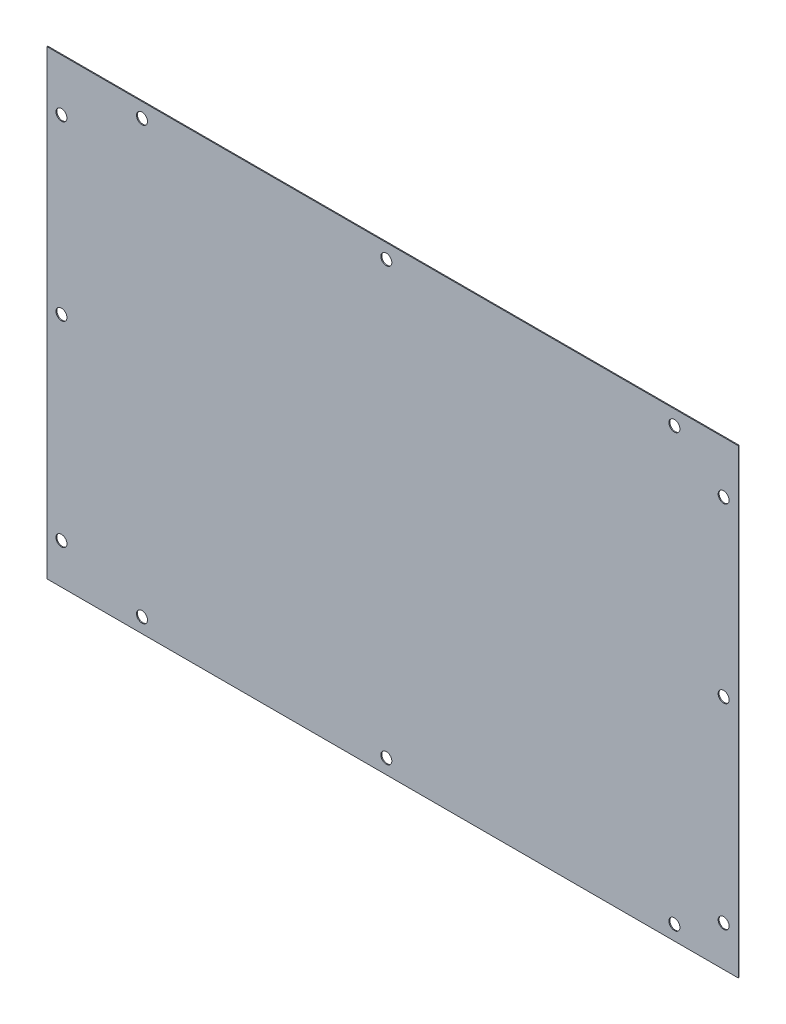
ISO-10303-21;
HEADER;
FILE_DESCRIPTION(('STEP AP214'),'2;1');
FILE_NAME('part.step','',(''),(''),'','','');
FILE_SCHEMA(('AUTOMOTIVE_DESIGN { 1 0 10303 214 1 1 1 1 }'));
ENDSEC;
DATA;
#1=APPLICATION_CONTEXT('core data for automotive mechanical design processes');
#2=APPLICATION_PROTOCOL_DEFINITION('international standard','automotive_design',2000,#1);
#3=PRODUCT_CONTEXT('',#1,'mechanical');
#4=PRODUCT('Part','Part','',(#3));
#5=PRODUCT_RELATED_PRODUCT_CATEGORY('part','',(#4));
#6=PRODUCT_DEFINITION_FORMATION('','',#4);
#7=PRODUCT_DEFINITION_CONTEXT('part definition',#1,'design');
#8=PRODUCT_DEFINITION('design','',#6,#7);
#9=PRODUCT_DEFINITION_SHAPE('','',#8);
#10=(LENGTH_UNIT() NAMED_UNIT(*) SI_UNIT(.MILLI.,.METRE.));
#11=(NAMED_UNIT(*) PLANE_ANGLE_UNIT() SI_UNIT($,.RADIAN.));
#12=(NAMED_UNIT(*) SI_UNIT($,.STERADIAN.) SOLID_ANGLE_UNIT());
#13=UNCERTAINTY_MEASURE_WITH_UNIT(LENGTH_MEASURE(1.E-05),#10,'distance_accuracy_value','');
#14=(GEOMETRIC_REPRESENTATION_CONTEXT(3) GLOBAL_UNCERTAINTY_ASSIGNED_CONTEXT((#13)) GLOBAL_UNIT_ASSIGNED_CONTEXT((#10,
#11,#12)) REPRESENTATION_CONTEXT('',''));
#15=CARTESIAN_POINT('',(0.,0.,0.));
#16=DIRECTION('',(0.,0.,1.));
#17=DIRECTION('',(1.,0.,0.));
#18=AXIS2_PLACEMENT_3D('',#15,#16,#17);
#19=CARTESIAN_POINT('',(0.,0.,0.79375));
#20=DIRECTION('',(0.,0.,1.));
#21=DIRECTION('',(1.,0.,0.));
#22=AXIS2_PLACEMENT_3D('',#19,#20,#21);
#23=PLANE('',#22);
#24=CARTESIAN_POINT('',(587.3,205.,0.79375));
#25=DIRECTION('',(0.,0.,1.));
#26=DIRECTION('',(1.,0.,0.));
#27=AXIS2_PLACEMENT_3D('',#24,#25,#26);
#28=CIRCLE('',#27,4.76250000000001);
#29=CARTESIAN_POINT('',(592.0625,205.,0.79375));
#30=VERTEX_POINT('',#29);
#31=EDGE_CURVE('E206',#30,#30,#28,.T.);
#32=ORIENTED_EDGE('',*,*,#31,.F.);
#33=EDGE_LOOP('',(#32));
#34=FACE_BOUND('',#33,.T.);
#35=CARTESIAN_POINT('',(544.6,12.7,0.79375));
#36=DIRECTION('',(0.,0.,1.));
#37=DIRECTION('',(1.,0.,0.));
#38=AXIS2_PLACEMENT_3D('',#35,#36,#37);
#39=CIRCLE('',#38,4.76250000000001);
#40=CARTESIAN_POINT('',(549.3625,12.7,0.79375));
#41=VERTEX_POINT('',#40);
#42=EDGE_CURVE('E190',#41,#41,#39,.T.);
#43=ORIENTED_EDGE('',*,*,#42,.F.);
#44=EDGE_LOOP('',(#43));
#45=FACE_BOUND('',#44,.T.);
#46=CARTESIAN_POINT('',(82.5919658889309,12.7,0.79375));
#47=DIRECTION('',(0.,0.,1.));
#48=DIRECTION('',(1.,0.,0.));
#49=AXIS2_PLACEMENT_3D('',#46,#47,#48);
#50=CIRCLE('',#49,4.7625);
#51=CARTESIAN_POINT('',(87.3544658889309,12.7,0.79375));
#52=VERTEX_POINT('',#51);
#53=EDGE_CURVE('E174',#52,#52,#50,.T.);
#54=ORIENTED_EDGE('',*,*,#53,.F.);
#55=EDGE_LOOP('',(#54));
#56=FACE_BOUND('',#55,.T.);
#57=CARTESIAN_POINT('',(12.7,205.,0.79375));
#58=DIRECTION('',(0.,0.,1.));
#59=DIRECTION('',(1.,0.,0.));
#60=AXIS2_PLACEMENT_3D('',#57,#58,#59);
#61=CIRCLE('',#60,4.7625);
#62=CARTESIAN_POINT('',(17.4625,205.,0.79375));
#63=VERTEX_POINT('',#62);
#64=EDGE_CURVE('E158',#63,#63,#61,.T.);
#65=ORIENTED_EDGE('',*,*,#64,.F.);
#66=EDGE_LOOP('',(#65));
#67=FACE_BOUND('',#66,.T.);
#68=CARTESIAN_POINT('',(544.6,387.3,0.79375));
#69=DIRECTION('',(0.,0.,1.));
#70=DIRECTION('',(1.,0.,0.));
#71=AXIS2_PLACEMENT_3D('',#68,#69,#70);
#72=CIRCLE('',#71,4.76250000000001);
#73=CARTESIAN_POINT('',(549.3625,387.3,0.79375));
#74=VERTEX_POINT('',#73);
#75=EDGE_CURVE('E142',#74,#74,#72,.T.);
#76=ORIENTED_EDGE('',*,*,#75,.F.);
#77=EDGE_LOOP('',(#76));
#78=FACE_BOUND('',#77,.T.);
#79=CARTESIAN_POINT('',(82.5919658889309,387.3,0.79375));
#80=DIRECTION('',(0.,0.,1.));
#81=DIRECTION('',(1.,0.,0.));
#82=AXIS2_PLACEMENT_3D('',#79,#80,#81);
#83=CIRCLE('',#82,4.7625);
#84=CARTESIAN_POINT('',(87.3544658889309,387.3,0.79375));
#85=VERTEX_POINT('',#84);
#86=EDGE_CURVE('E112',#85,#85,#83,.T.);
#87=ORIENTED_EDGE('',*,*,#86,.F.);
#88=EDGE_LOOP('',(#87));
#89=FACE_BOUND('',#88,.T.);
#90=DIRECTION('',(0.,-1.,0.));
#91=VECTOR('',#90,1.);
#92=CARTESIAN_POINT('',(0.,400.,0.79375));
#93=LINE('',#92,#91);
#94=CARTESIAN_POINT('',(0.,400.,0.79375));
#95=VERTEX_POINT('',#94);
#96=CARTESIAN_POINT('',(0.,0.,0.79375));
#97=VERTEX_POINT('',#96);
#98=EDGE_CURVE('E92',#95,#97,#93,.T.);
#99=ORIENTED_EDGE('',*,*,#98,.T.);
#100=DIRECTION('',(1.,0.,0.));
#101=VECTOR('',#100,1.);
#102=CARTESIAN_POINT('',(0.,0.,0.79375));
#103=LINE('',#102,#101);
#104=CARTESIAN_POINT('',(600.,0.,0.79375));
#105=VERTEX_POINT('',#104);
#106=EDGE_CURVE('E87',#97,#105,#103,.T.);
#107=ORIENTED_EDGE('',*,*,#106,.T.);
#108=DIRECTION('',(0.,1.,0.));
#109=VECTOR('',#108,1.);
#110=CARTESIAN_POINT('',(600.,400.,0.79375));
#111=LINE('',#110,#109);
#112=CARTESIAN_POINT('',(600.,400.,0.79375));
#113=VERTEX_POINT('',#112);
#114=EDGE_CURVE('E90',#105,#113,#111,.T.);
#115=ORIENTED_EDGE('',*,*,#114,.T.);
#116=DIRECTION('',(-1.,0.,0.));
#117=VECTOR('',#116,1.);
#118=CARTESIAN_POINT('',(0.,400.,0.79375));
#119=LINE('',#118,#117);
#120=EDGE_CURVE('E57',#113,#95,#119,.T.);
#121=ORIENTED_EDGE('',*,*,#120,.T.);
#122=EDGE_LOOP('',(#99,#107,#115,#121));
#123=FACE_BOUND('',#122,.T.);
#124=CARTESIAN_POINT('',(294.6,387.3,0.79375));
#125=DIRECTION('',(0.,0.,1.));
#126=DIRECTION('',(1.,0.,0.));
#127=AXIS2_PLACEMENT_3D('',#124,#125,#126);
#128=CIRCLE('',#127,4.76250000000001);
#129=CARTESIAN_POINT('',(299.3625,387.3,0.79375));
#130=VERTEX_POINT('',#129);
#131=EDGE_CURVE('E134',#130,#130,#128,.T.);
#132=ORIENTED_EDGE('',*,*,#131,.F.);
#133=EDGE_LOOP('',(#132));
#134=FACE_BOUND('',#133,.T.);
#135=CARTESIAN_POINT('',(12.7,355.,0.79375));
#136=DIRECTION('',(0.,0.,1.));
#137=DIRECTION('',(1.,0.,0.));
#138=AXIS2_PLACEMENT_3D('',#135,#136,#137);
#139=CIRCLE('',#138,4.7625);
#140=CARTESIAN_POINT('',(17.4625,355.,0.79375));
#141=VERTEX_POINT('',#140);
#142=EDGE_CURVE('E150',#141,#141,#139,.T.);
#143=ORIENTED_EDGE('',*,*,#142,.F.);
#144=EDGE_LOOP('',(#143));
#145=FACE_BOUND('',#144,.T.);
#146=CARTESIAN_POINT('',(12.7,35.,0.79375));
#147=DIRECTION('',(0.,0.,1.));
#148=DIRECTION('',(1.,0.,0.));
#149=AXIS2_PLACEMENT_3D('',#146,#147,#148);
#150=CIRCLE('',#149,4.7625);
#151=CARTESIAN_POINT('',(17.4625,35.,0.79375));
#152=VERTEX_POINT('',#151);
#153=EDGE_CURVE('E166',#152,#152,#150,.T.);
#154=ORIENTED_EDGE('',*,*,#153,.F.);
#155=EDGE_LOOP('',(#154));
#156=FACE_BOUND('',#155,.T.);
#157=CARTESIAN_POINT('',(294.6,12.7,0.79375));
#158=DIRECTION('',(0.,0.,1.));
#159=DIRECTION('',(1.,0.,0.));
#160=AXIS2_PLACEMENT_3D('',#157,#158,#159);
#161=CIRCLE('',#160,4.76250000000001);
#162=CARTESIAN_POINT('',(299.3625,12.7,0.79375));
#163=VERTEX_POINT('',#162);
#164=EDGE_CURVE('E182',#163,#163,#161,.T.);
#165=ORIENTED_EDGE('',*,*,#164,.F.);
#166=EDGE_LOOP('',(#165));
#167=FACE_BOUND('',#166,.T.);
#168=CARTESIAN_POINT('',(587.3,355.,0.79375));
#169=DIRECTION('',(0.,0.,1.));
#170=DIRECTION('',(1.,0.,0.));
#171=AXIS2_PLACEMENT_3D('',#168,#169,#170);
#172=CIRCLE('',#171,4.76250000000001);
#173=CARTESIAN_POINT('',(592.0625,355.,0.79375));
#174=VERTEX_POINT('',#173);
#175=EDGE_CURVE('E198',#174,#174,#172,.T.);
#176=ORIENTED_EDGE('',*,*,#175,.F.);
#177=EDGE_LOOP('',(#176));
#178=FACE_BOUND('',#177,.T.);
#179=CARTESIAN_POINT('',(587.3,35.,0.79375));
#180=DIRECTION('',(0.,0.,1.));
#181=DIRECTION('',(1.,0.,0.));
#182=AXIS2_PLACEMENT_3D('',#179,#180,#181);
#183=CIRCLE('',#182,4.76250000000001);
#184=CARTESIAN_POINT('',(592.0625,35.,0.79375));
#185=VERTEX_POINT('',#184);
#186=EDGE_CURVE('E214',#185,#185,#183,.T.);
#187=ORIENTED_EDGE('',*,*,#186,.F.);
#188=EDGE_LOOP('',(#187));
#189=FACE_BOUND('',#188,.T.);
#190=ADVANCED_FACE('F39',(#34,#45,#56,#67,#78,#89,#123,#134,#145,#156,#167,#178,#189),#23,.T.);
#191=CARTESIAN_POINT('',(0.,0.,0.));
#192=DIRECTION('',(0.,0.,1.));
#193=DIRECTION('',(1.,0.,0.));
#194=AXIS2_PLACEMENT_3D('',#191,#192,#193);
#195=PLANE('',#194);
#196=DIRECTION('',(0.,-1.,0.));
#197=VECTOR('',#196,1.);
#198=CARTESIAN_POINT('',(0.,400.,0.));
#199=LINE('',#198,#197);
#200=CARTESIAN_POINT('',(0.,400.,0.));
#201=VERTEX_POINT('',#200);
#202=CARTESIAN_POINT('',(0.,0.,0.));
#203=VERTEX_POINT('',#202);
#204=EDGE_CURVE('E108',#201,#203,#199,.T.);
#205=ORIENTED_EDGE('',*,*,#204,.F.);
#206=DIRECTION('',(-1.,0.,0.));
#207=VECTOR('',#206,1.);
#208=CARTESIAN_POINT('',(0.,400.,0.));
#209=LINE('',#208,#207);
#210=CARTESIAN_POINT('',(600.,400.,0.));
#211=VERTEX_POINT('',#210);
#212=EDGE_CURVE('E80',#211,#201,#209,.T.);
#213=ORIENTED_EDGE('',*,*,#212,.F.);
#214=DIRECTION('',(0.,1.,0.));
#215=VECTOR('',#214,1.);
#216=CARTESIAN_POINT('',(600.,400.,0.));
#217=LINE('',#216,#215);
#218=CARTESIAN_POINT('',(600.,0.,0.));
#219=VERTEX_POINT('',#218);
#220=EDGE_CURVE('E74',#219,#211,#217,.T.);
#221=ORIENTED_EDGE('',*,*,#220,.F.);
#222=DIRECTION('',(1.,0.,0.));
#223=VECTOR('',#222,1.);
#224=CARTESIAN_POINT('',(0.,0.,0.));
#225=LINE('',#224,#223);
#226=EDGE_CURVE('E97',#203,#219,#225,.T.);
#227=ORIENTED_EDGE('',*,*,#226,.F.);
#228=EDGE_LOOP('',(#205,#213,#221,#227));
#229=FACE_BOUND('',#228,.T.);
#230=CARTESIAN_POINT('',(82.5919658889309,387.3,0.));
#231=DIRECTION('',(0.,0.,1.));
#232=DIRECTION('',(1.,0.,0.));
#233=AXIS2_PLACEMENT_3D('',#230,#231,#232);
#234=CIRCLE('',#233,4.7625);
#235=CARTESIAN_POINT('',(87.3544658889309,387.3,0.));
#236=VERTEX_POINT('',#235);
#237=EDGE_CURVE('E130',#236,#236,#234,.T.);
#238=ORIENTED_EDGE('',*,*,#237,.T.);
#239=EDGE_LOOP('',(#238));
#240=FACE_BOUND('',#239,.T.);
#241=CARTESIAN_POINT('',(294.6,387.3,0.));
#242=DIRECTION('',(0.,0.,1.));
#243=DIRECTION('',(1.,0.,0.));
#244=AXIS2_PLACEMENT_3D('',#241,#242,#243);
#245=CIRCLE('',#244,4.76250000000001);
#246=CARTESIAN_POINT('',(299.3625,387.3,0.));
#247=VERTEX_POINT('',#246);
#248=EDGE_CURVE('E138',#247,#247,#245,.T.);
#249=ORIENTED_EDGE('',*,*,#248,.T.);
#250=EDGE_LOOP('',(#249));
#251=FACE_BOUND('',#250,.T.);
#252=CARTESIAN_POINT('',(544.6,387.3,0.));
#253=DIRECTION('',(0.,0.,1.));
#254=DIRECTION('',(1.,0.,0.));
#255=AXIS2_PLACEMENT_3D('',#252,#253,#254);
#256=CIRCLE('',#255,4.76250000000001);
#257=CARTESIAN_POINT('',(549.3625,387.3,0.));
#258=VERTEX_POINT('',#257);
#259=EDGE_CURVE('E146',#258,#258,#256,.T.);
#260=ORIENTED_EDGE('',*,*,#259,.T.);
#261=EDGE_LOOP('',(#260));
#262=FACE_BOUND('',#261,.T.);
#263=CARTESIAN_POINT('',(12.7,355.,0.));
#264=DIRECTION('',(0.,0.,1.));
#265=DIRECTION('',(1.,0.,0.));
#266=AXIS2_PLACEMENT_3D('',#263,#264,#265);
#267=CIRCLE('',#266,4.7625);
#268=CARTESIAN_POINT('',(17.4625,355.,0.));
#269=VERTEX_POINT('',#268);
#270=EDGE_CURVE('E154',#269,#269,#267,.T.);
#271=ORIENTED_EDGE('',*,*,#270,.T.);
#272=EDGE_LOOP('',(#271));
#273=FACE_BOUND('',#272,.T.);
#274=CARTESIAN_POINT('',(12.7,205.,0.));
#275=DIRECTION('',(0.,0.,1.));
#276=DIRECTION('',(1.,0.,0.));
#277=AXIS2_PLACEMENT_3D('',#274,#275,#276);
#278=CIRCLE('',#277,4.7625);
#279=CARTESIAN_POINT('',(17.4625,205.,0.));
#280=VERTEX_POINT('',#279);
#281=EDGE_CURVE('E162',#280,#280,#278,.T.);
#282=ORIENTED_EDGE('',*,*,#281,.T.);
#283=EDGE_LOOP('',(#282));
#284=FACE_BOUND('',#283,.T.);
#285=CARTESIAN_POINT('',(12.7,35.,0.));
#286=DIRECTION('',(0.,0.,1.));
#287=DIRECTION('',(1.,0.,0.));
#288=AXIS2_PLACEMENT_3D('',#285,#286,#287);
#289=CIRCLE('',#288,4.7625);
#290=CARTESIAN_POINT('',(17.4625,35.,0.));
#291=VERTEX_POINT('',#290);
#292=EDGE_CURVE('E170',#291,#291,#289,.T.);
#293=ORIENTED_EDGE('',*,*,#292,.T.);
#294=EDGE_LOOP('',(#293));
#295=FACE_BOUND('',#294,.T.);
#296=CARTESIAN_POINT('',(82.5919658889309,12.7,0.));
#297=DIRECTION('',(0.,0.,1.));
#298=DIRECTION('',(1.,0.,0.));
#299=AXIS2_PLACEMENT_3D('',#296,#297,#298);
#300=CIRCLE('',#299,4.7625);
#301=CARTESIAN_POINT('',(87.3544658889309,12.7,0.));
#302=VERTEX_POINT('',#301);
#303=EDGE_CURVE('E178',#302,#302,#300,.T.);
#304=ORIENTED_EDGE('',*,*,#303,.T.);
#305=EDGE_LOOP('',(#304));
#306=FACE_BOUND('',#305,.T.);
#307=CARTESIAN_POINT('',(294.6,12.7,0.));
#308=DIRECTION('',(0.,0.,1.));
#309=DIRECTION('',(1.,0.,0.));
#310=AXIS2_PLACEMENT_3D('',#307,#308,#309);
#311=CIRCLE('',#310,4.76250000000001);
#312=CARTESIAN_POINT('',(299.3625,12.7,0.));
#313=VERTEX_POINT('',#312);
#314=EDGE_CURVE('E186',#313,#313,#311,.T.);
#315=ORIENTED_EDGE('',*,*,#314,.T.);
#316=EDGE_LOOP('',(#315));
#317=FACE_BOUND('',#316,.T.);
#318=CARTESIAN_POINT('',(544.6,12.7,0.));
#319=DIRECTION('',(0.,0.,1.));
#320=DIRECTION('',(1.,0.,0.));
#321=AXIS2_PLACEMENT_3D('',#318,#319,#320);
#322=CIRCLE('',#321,4.76250000000001);
#323=CARTESIAN_POINT('',(549.3625,12.7,0.));
#324=VERTEX_POINT('',#323);
#325=EDGE_CURVE('E194',#324,#324,#322,.T.);
#326=ORIENTED_EDGE('',*,*,#325,.T.);
#327=EDGE_LOOP('',(#326));
#328=FACE_BOUND('',#327,.T.);
#329=CARTESIAN_POINT('',(587.3,355.,0.));
#330=DIRECTION('',(0.,0.,1.));
#331=DIRECTION('',(1.,0.,0.));
#332=AXIS2_PLACEMENT_3D('',#329,#330,#331);
#333=CIRCLE('',#332,4.76250000000001);
#334=CARTESIAN_POINT('',(592.0625,355.,0.));
#335=VERTEX_POINT('',#334);
#336=EDGE_CURVE('E202',#335,#335,#333,.T.);
#337=ORIENTED_EDGE('',*,*,#336,.T.);
#338=EDGE_LOOP('',(#337));
#339=FACE_BOUND('',#338,.T.);
#340=CARTESIAN_POINT('',(587.3,205.,0.));
#341=DIRECTION('',(0.,0.,1.));
#342=DIRECTION('',(1.,0.,0.));
#343=AXIS2_PLACEMENT_3D('',#340,#341,#342);
#344=CIRCLE('',#343,4.76250000000001);
#345=CARTESIAN_POINT('',(592.0625,205.,0.));
#346=VERTEX_POINT('',#345);
#347=EDGE_CURVE('E210',#346,#346,#344,.T.);
#348=ORIENTED_EDGE('',*,*,#347,.T.);
#349=EDGE_LOOP('',(#348));
#350=FACE_BOUND('',#349,.T.);
#351=CARTESIAN_POINT('',(587.3,35.,0.));
#352=DIRECTION('',(0.,0.,1.));
#353=DIRECTION('',(1.,0.,0.));
#354=AXIS2_PLACEMENT_3D('',#351,#352,#353);
#355=CIRCLE('',#354,4.76250000000001);
#356=CARTESIAN_POINT('',(592.0625,35.,0.));
#357=VERTEX_POINT('',#356);
#358=EDGE_CURVE('E218',#357,#357,#355,.T.);
#359=ORIENTED_EDGE('',*,*,#358,.T.);
#360=EDGE_LOOP('',(#359));
#361=FACE_BOUND('',#360,.T.);
#362=ADVANCED_FACE('F125',(#229,#240,#251,#262,#273,#284,#295,#306,#317,#328,#339,#350,#361),
#195,.F.);
#363=CARTESIAN_POINT('',(0.,400.,0.79375));
#364=DIRECTION('',(1.,0.,0.));
#365=DIRECTION('',(0.,1.,0.));
#366=AXIS2_PLACEMENT_3D('',#363,#364,#365);
#367=PLANE('',#366);
#368=ORIENTED_EDGE('',*,*,#204,.T.);
#369=DIRECTION('',(0.,0.,-1.));
#370=VECTOR('',#369,1.);
#371=CARTESIAN_POINT('',(0.,0.,0.79375));
#372=LINE('',#371,#370);
#373=EDGE_CURVE('E11',#97,#203,#372,.T.);
#374=ORIENTED_EDGE('',*,*,#373,.F.);
#375=ORIENTED_EDGE('',*,*,#98,.F.);
#376=DIRECTION('',(0.,0.,-1.));
#377=VECTOR('',#376,1.);
#378=CARTESIAN_POINT('',(0.,400.,0.79375));
#379=LINE('',#378,#377);
#380=EDGE_CURVE('E104',#95,#201,#379,.T.);
#381=ORIENTED_EDGE('',*,*,#380,.T.);
#382=EDGE_LOOP('',(#368,#374,#375,#381));
#383=FACE_BOUND('',#382,.T.);
#384=ADVANCED_FACE('F41',(#383),#367,.F.);
#385=CARTESIAN_POINT('',(0.,0.,0.79375));
#386=DIRECTION('',(0.,1.,0.));
#387=DIRECTION('',(0.,0.,1.));
#388=AXIS2_PLACEMENT_3D('',#385,#386,#387);
#389=PLANE('',#388);
#390=ORIENTED_EDGE('',*,*,#226,.T.);
#391=DIRECTION('',(0.,0.,-1.));
#392=VECTOR('',#391,1.);
#393=CARTESIAN_POINT('',(600.,0.,0.79375));
#394=LINE('',#393,#392);
#395=EDGE_CURVE('E49',#105,#219,#394,.T.);
#396=ORIENTED_EDGE('',*,*,#395,.F.);
#397=ORIENTED_EDGE('',*,*,#106,.F.);
#398=ORIENTED_EDGE('',*,*,#373,.T.);
#399=EDGE_LOOP('',(#390,#396,#397,#398));
#400=FACE_BOUND('',#399,.T.);
#401=ADVANCED_FACE('F96',(#400),#389,.F.);
#402=CARTESIAN_POINT('',(600.,400.,0.79375));
#403=DIRECTION('',(-1.,0.,0.));
#404=DIRECTION('',(0.,0.,1.));
#405=AXIS2_PLACEMENT_3D('',#402,#403,#404);
#406=PLANE('',#405);
#407=ORIENTED_EDGE('',*,*,#220,.T.);
#408=DIRECTION('',(0.,0.,-1.));
#409=VECTOR('',#408,1.);
#410=CARTESIAN_POINT('',(600.,400.,0.79375));
#411=LINE('',#410,#409);
#412=EDGE_CURVE('E99',#113,#211,#411,.T.);
#413=ORIENTED_EDGE('',*,*,#412,.F.);
#414=ORIENTED_EDGE('',*,*,#114,.F.);
#415=ORIENTED_EDGE('',*,*,#395,.T.);
#416=EDGE_LOOP('',(#407,#413,#414,#415));
#417=FACE_BOUND('',#416,.T.);
#418=ADVANCED_FACE('F100',(#417),#406,.F.);
#419=CARTESIAN_POINT('',(0.,400.,0.79375));
#420=DIRECTION('',(0.,-1.,0.));
#421=DIRECTION('',(0.,0.,-1.));
#422=AXIS2_PLACEMENT_3D('',#419,#420,#421);
#423=PLANE('',#422);
#424=ORIENTED_EDGE('',*,*,#212,.T.);
#425=ORIENTED_EDGE('',*,*,#380,.F.);
#426=ORIENTED_EDGE('',*,*,#120,.F.);
#427=ORIENTED_EDGE('',*,*,#412,.T.);
#428=EDGE_LOOP('',(#424,#425,#426,#427));
#429=FACE_BOUND('',#428,.T.);
#430=ADVANCED_FACE('F122',(#429),#423,.F.);
#431=CARTESIAN_POINT('',(82.5919658889309,387.3,0.79375));
#432=DIRECTION('',(0.,0.,-1.));
#433=DIRECTION('',(-1.,0.,0.));
#434=AXIS2_PLACEMENT_3D('',#431,#432,#433);
#435=CYLINDRICAL_SURFACE('',#434,4.7625);
#436=ORIENTED_EDGE('',*,*,#86,.T.);
#437=EDGE_LOOP('',(#436));
#438=FACE_BOUND('',#437,.T.);
#439=ORIENTED_EDGE('',*,*,#237,.F.);
#440=EDGE_LOOP('',(#439));
#441=FACE_BOUND('',#440,.T.);
#442=ADVANCED_FACE('F239',(#438,#441),#435,.F.);
#443=CARTESIAN_POINT('',(294.6,387.3,0.79375));
#444=DIRECTION('',(0.,0.,-1.));
#445=DIRECTION('',(-1.,0.,0.));
#446=AXIS2_PLACEMENT_3D('',#443,#444,#445);
#447=CYLINDRICAL_SURFACE('',#446,4.76250000000001);
#448=ORIENTED_EDGE('',*,*,#131,.T.);
#449=EDGE_LOOP('',(#448));
#450=FACE_BOUND('',#449,.T.);
#451=ORIENTED_EDGE('',*,*,#248,.F.);
#452=EDGE_LOOP('',(#451));
#453=FACE_BOUND('',#452,.T.);
#454=ADVANCED_FACE('F285',(#450,#453),#447,.F.);
#455=CARTESIAN_POINT('',(544.6,387.3,0.79375));
#456=DIRECTION('',(0.,0.,-1.));
#457=DIRECTION('',(-1.,0.,0.));
#458=AXIS2_PLACEMENT_3D('',#455,#456,#457);
#459=CYLINDRICAL_SURFACE('',#458,4.76250000000001);
#460=ORIENTED_EDGE('',*,*,#75,.T.);
#461=EDGE_LOOP('',(#460));
#462=FACE_BOUND('',#461,.T.);
#463=ORIENTED_EDGE('',*,*,#259,.F.);
#464=EDGE_LOOP('',(#463));
#465=FACE_BOUND('',#464,.T.);
#466=ADVANCED_FACE('F293',(#462,#465),#459,.F.);
#467=CARTESIAN_POINT('',(12.7,355.,0.79375));
#468=DIRECTION('',(0.,0.,-1.));
#469=DIRECTION('',(-1.,0.,0.));
#470=AXIS2_PLACEMENT_3D('',#467,#468,#469);
#471=CYLINDRICAL_SURFACE('',#470,4.7625);
#472=ORIENTED_EDGE('',*,*,#142,.T.);
#473=EDGE_LOOP('',(#472));
#474=FACE_BOUND('',#473,.T.);
#475=ORIENTED_EDGE('',*,*,#270,.F.);
#476=EDGE_LOOP('',(#475));
#477=FACE_BOUND('',#476,.T.);
#478=ADVANCED_FACE('F301',(#474,#477),#471,.F.);
#479=CARTESIAN_POINT('',(12.7,205.,0.79375));
#480=DIRECTION('',(0.,0.,-1.));
#481=DIRECTION('',(-1.,0.,0.));
#482=AXIS2_PLACEMENT_3D('',#479,#480,#481);
#483=CYLINDRICAL_SURFACE('',#482,4.7625);
#484=ORIENTED_EDGE('',*,*,#64,.T.);
#485=EDGE_LOOP('',(#484));
#486=FACE_BOUND('',#485,.T.);
#487=ORIENTED_EDGE('',*,*,#281,.F.);
#488=EDGE_LOOP('',(#487));
#489=FACE_BOUND('',#488,.T.);
#490=ADVANCED_FACE('F310',(#486,#489),#483,.F.);
#491=CARTESIAN_POINT('',(12.7,35.,0.79375));
#492=DIRECTION('',(0.,0.,-1.));
#493=DIRECTION('',(-1.,0.,0.));
#494=AXIS2_PLACEMENT_3D('',#491,#492,#493);
#495=CYLINDRICAL_SURFACE('',#494,4.7625);
#496=ORIENTED_EDGE('',*,*,#153,.T.);
#497=EDGE_LOOP('',(#496));
#498=FACE_BOUND('',#497,.T.);
#499=ORIENTED_EDGE('',*,*,#292,.F.);
#500=EDGE_LOOP('',(#499));
#501=FACE_BOUND('',#500,.T.);
#502=ADVANCED_FACE('F319',(#498,#501),#495,.F.);
#503=CARTESIAN_POINT('',(82.5919658889309,12.7,0.79375));
#504=DIRECTION('',(0.,0.,-1.));
#505=DIRECTION('',(-1.,0.,0.));
#506=AXIS2_PLACEMENT_3D('',#503,#504,#505);
#507=CYLINDRICAL_SURFACE('',#506,4.7625);
#508=ORIENTED_EDGE('',*,*,#53,.T.);
#509=EDGE_LOOP('',(#508));
#510=FACE_BOUND('',#509,.T.);
#511=ORIENTED_EDGE('',*,*,#303,.F.);
#512=EDGE_LOOP('',(#511));
#513=FACE_BOUND('',#512,.T.);
#514=ADVANCED_FACE('F328',(#510,#513),#507,.F.);
#515=CARTESIAN_POINT('',(294.6,12.7,0.79375));
#516=DIRECTION('',(0.,0.,-1.));
#517=DIRECTION('',(-1.,0.,0.));
#518=AXIS2_PLACEMENT_3D('',#515,#516,#517);
#519=CYLINDRICAL_SURFACE('',#518,4.76250000000001);
#520=ORIENTED_EDGE('',*,*,#164,.T.);
#521=EDGE_LOOP('',(#520));
#522=FACE_BOUND('',#521,.T.);
#523=ORIENTED_EDGE('',*,*,#314,.F.);
#524=EDGE_LOOP('',(#523));
#525=FACE_BOUND('',#524,.T.);
#526=ADVANCED_FACE('F337',(#522,#525),#519,.F.);
#527=CARTESIAN_POINT('',(544.6,12.7,0.79375));
#528=DIRECTION('',(0.,0.,-1.));
#529=DIRECTION('',(-1.,0.,0.));
#530=AXIS2_PLACEMENT_3D('',#527,#528,#529);
#531=CYLINDRICAL_SURFACE('',#530,4.76250000000001);
#532=ORIENTED_EDGE('',*,*,#42,.T.);
#533=EDGE_LOOP('',(#532));
#534=FACE_BOUND('',#533,.T.);
#535=ORIENTED_EDGE('',*,*,#325,.F.);
#536=EDGE_LOOP('',(#535));
#537=FACE_BOUND('',#536,.T.);
#538=ADVANCED_FACE('F346',(#534,#537),#531,.F.);
#539=CARTESIAN_POINT('',(587.3,355.,0.79375));
#540=DIRECTION('',(0.,0.,-1.));
#541=DIRECTION('',(-1.,0.,0.));
#542=AXIS2_PLACEMENT_3D('',#539,#540,#541);
#543=CYLINDRICAL_SURFACE('',#542,4.76250000000001);
#544=ORIENTED_EDGE('',*,*,#175,.T.);
#545=EDGE_LOOP('',(#544));
#546=FACE_BOUND('',#545,.T.);
#547=ORIENTED_EDGE('',*,*,#336,.F.);
#548=EDGE_LOOP('',(#547));
#549=FACE_BOUND('',#548,.T.);
#550=ADVANCED_FACE('F355',(#546,#549),#543,.F.);
#551=CARTESIAN_POINT('',(587.3,205.,0.79375));
#552=DIRECTION('',(0.,0.,-1.));
#553=DIRECTION('',(-1.,0.,0.));
#554=AXIS2_PLACEMENT_3D('',#551,#552,#553);
#555=CYLINDRICAL_SURFACE('',#554,4.76250000000001);
#556=ORIENTED_EDGE('',*,*,#31,.T.);
#557=EDGE_LOOP('',(#556));
#558=FACE_BOUND('',#557,.T.);
#559=ORIENTED_EDGE('',*,*,#347,.F.);
#560=EDGE_LOOP('',(#559));
#561=FACE_BOUND('',#560,.T.);
#562=ADVANCED_FACE('F364',(#558,#561),#555,.F.);
#563=CARTESIAN_POINT('',(587.3,35.,0.79375));
#564=DIRECTION('',(0.,0.,-1.));
#565=DIRECTION('',(-1.,0.,0.));
#566=AXIS2_PLACEMENT_3D('',#563,#564,#565);
#567=CYLINDRICAL_SURFACE('',#566,4.76250000000001);
#568=ORIENTED_EDGE('',*,*,#186,.T.);
#569=EDGE_LOOP('',(#568));
#570=FACE_BOUND('',#569,.T.);
#571=ORIENTED_EDGE('',*,*,#358,.F.);
#572=EDGE_LOOP('',(#571));
#573=FACE_BOUND('',#572,.T.);
#574=ADVANCED_FACE('F226',(#570,#573),#567,.F.);
#575=CLOSED_SHELL('',(#190,#362,#384,#401,#418,#430,#442,#454,#466,#478,#490,#502,#514,#526,
#538,#550,#562,#574));
#576=MANIFOLD_SOLID_BREP('B2',#575);
#577=ADVANCED_BREP_SHAPE_REPRESENTATION('',(#18,#576),#14);
#578=SHAPE_DEFINITION_REPRESENTATION(#9,#577);
ENDSEC;
END-ISO-10303-21;
